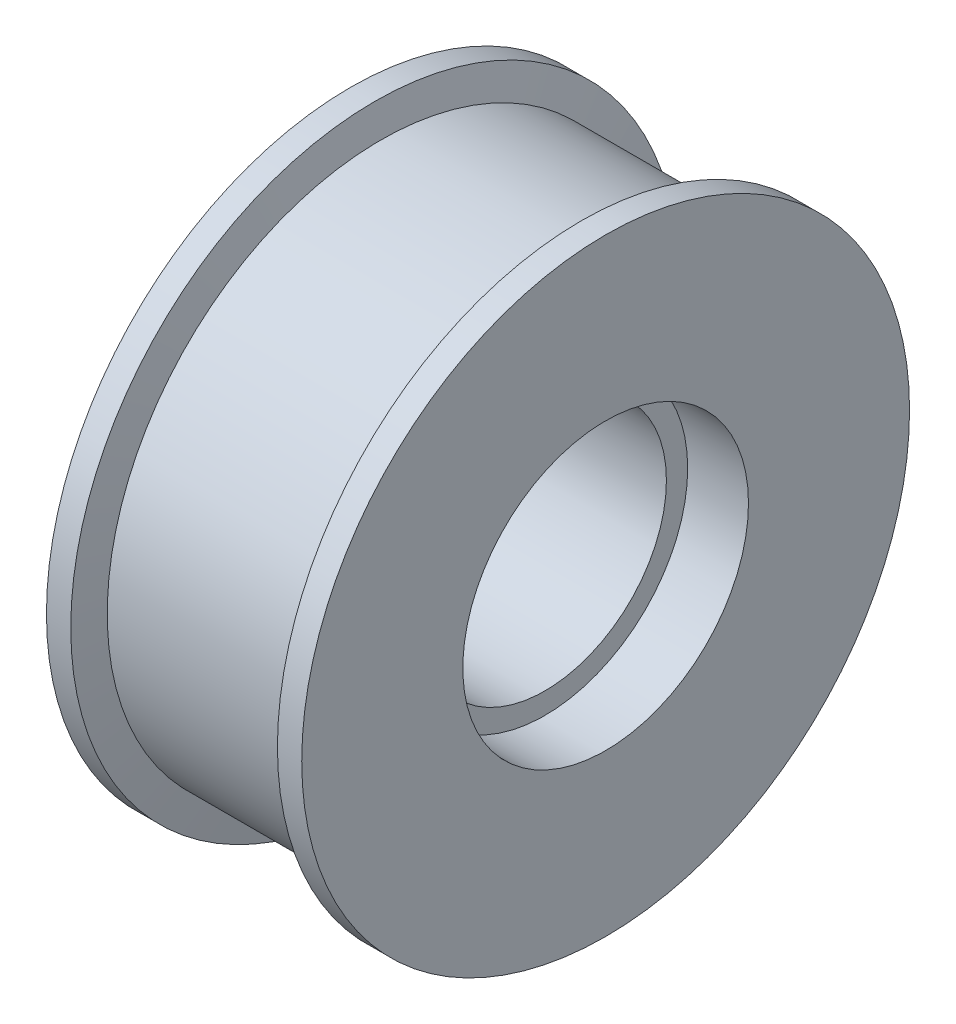
ISO-10303-21;
HEADER;
FILE_DESCRIPTION(('STEP AP214'),'2;1');
FILE_NAME('part.step','',(''),(''),'','','');
FILE_SCHEMA(('AUTOMOTIVE_DESIGN { 1 0 10303 214 1 1 1 1 }'));
ENDSEC;
DATA;
#1=APPLICATION_CONTEXT('core data for automotive mechanical design processes');
#2=APPLICATION_PROTOCOL_DEFINITION('international standard','automotive_design',2000,#1);
#3=PRODUCT_CONTEXT('',#1,'mechanical');
#4=PRODUCT('Part','Part','',(#3));
#5=PRODUCT_RELATED_PRODUCT_CATEGORY('part','',(#4));
#6=PRODUCT_DEFINITION_FORMATION('','',#4);
#7=PRODUCT_DEFINITION_CONTEXT('part definition',#1,'design');
#8=PRODUCT_DEFINITION('design','',#6,#7);
#9=PRODUCT_DEFINITION_SHAPE('','',#8);
#10=(LENGTH_UNIT() NAMED_UNIT(*) SI_UNIT(.MILLI.,.METRE.));
#11=(NAMED_UNIT(*) PLANE_ANGLE_UNIT() SI_UNIT($,.RADIAN.));
#12=(NAMED_UNIT(*) SI_UNIT($,.STERADIAN.) SOLID_ANGLE_UNIT());
#13=UNCERTAINTY_MEASURE_WITH_UNIT(LENGTH_MEASURE(1.E-05),#10,'distance_accuracy_value','');
#14=(GEOMETRIC_REPRESENTATION_CONTEXT(3) GLOBAL_UNCERTAINTY_ASSIGNED_CONTEXT((#13)) GLOBAL_UNIT_ASSIGNED_CONTEXT((#10,
#11,#12)) REPRESENTATION_CONTEXT('',''));
#15=CARTESIAN_POINT('',(0.,0.,0.));
#16=DIRECTION('',(0.,0.,1.));
#17=DIRECTION('',(1.,0.,0.));
#18=AXIS2_PLACEMENT_3D('',#15,#16,#17);
#19=CARTESIAN_POINT('',(43.903105843662,-758.58002712801,663.895907566101));
#20=DIRECTION('',(1.,0.,0.));
#21=DIRECTION('',(0.,0.,-1.));
#22=AXIS2_PLACEMENT_3D('',#19,#20,#21);
#23=CYLINDRICAL_SURFACE('',#22,23.5);
#24=CARTESIAN_POINT('',(22.8923695623669,-758.58002712801,663.895907566101));
#25=DIRECTION('',(1.,0.,0.));
#26=DIRECTION('',(0.,0.,-1.));
#27=AXIS2_PLACEMENT_3D('',#24,#25,#26);
#28=CIRCLE('',#27,23.5);
#29=CARTESIAN_POINT('',(22.8923695623669,-758.58002712801,640.395907566101));
#30=VERTEX_POINT('',#29);
#31=EDGE_CURVE('E70',#30,#30,#28,.T.);
#32=ORIENTED_EDGE('',*,*,#31,.F.);
#33=EDGE_LOOP('',(#32));
#34=FACE_BOUND('',#33,.T.);
#35=CARTESIAN_POINT('',(32.892369562367,-758.58002712801,663.895907566101));
#36=DIRECTION('',(1.,0.,0.));
#37=DIRECTION('',(0.,0.,-1.));
#38=AXIS2_PLACEMENT_3D('',#35,#36,#37);
#39=CIRCLE('',#38,23.5);
#40=CARTESIAN_POINT('',(32.892369562367,-758.58002712801,640.395907566101));
#41=VERTEX_POINT('',#40);
#42=EDGE_CURVE('E10',#41,#41,#39,.T.);
#43=ORIENTED_EDGE('',*,*,#42,.T.);
#44=EDGE_LOOP('',(#43));
#45=FACE_BOUND('',#44,.T.);
#46=ADVANCED_FACE('F30',(#34,#45),#23,.F.);
#47=CARTESIAN_POINT('',(32.892369562367,-774.762591535569,646.855525845165));
#48=DIRECTION('',(-1.,0.,0.));
#49=DIRECTION('',(0.,0.,1.));
#50=AXIS2_PLACEMENT_3D('',#47,#48,#49);
#51=PLANE('',#50);
#52=ORIENTED_EDGE('',*,*,#42,.F.);
#53=EDGE_LOOP('',(#52));
#54=FACE_BOUND('',#53,.T.);
#55=CARTESIAN_POINT('',(32.892369562367,-758.58002712801,663.895907566101));
#56=DIRECTION('',(1.,0.,0.));
#57=DIRECTION('',(0.,0.,-1.));
#58=AXIS2_PLACEMENT_3D('',#55,#56,#57);
#59=CIRCLE('',#58,50.);
#60=CARTESIAN_POINT('',(32.892369562367,-758.58002712801,613.895907566101));
#61=VERTEX_POINT('',#60);
#62=EDGE_CURVE('E36',#61,#61,#59,.T.);
#63=ORIENTED_EDGE('',*,*,#62,.T.);
#64=EDGE_LOOP('',(#63));
#65=FACE_BOUND('',#64,.T.);
#66=ADVANCED_FACE('F77',(#54,#65),#51,.F.);
#67=CARTESIAN_POINT('',(43.903105843662,-758.58002712801,663.895907566101));
#68=DIRECTION('',(1.,0.,0.));
#69=DIRECTION('',(0.,0.,-1.));
#70=AXIS2_PLACEMENT_3D('',#67,#68,#69);
#71=CYLINDRICAL_SURFACE('',#70,50.);
#72=ORIENTED_EDGE('',*,*,#62,.F.);
#73=EDGE_LOOP('',(#72));
#74=FACE_BOUND('',#73,.T.);
#75=CARTESIAN_POINT('',(28.8923695623669,-758.58002712801,663.895907566101));
#76=DIRECTION('',(1.,0.,0.));
#77=DIRECTION('',(0.,0.,-1.));
#78=AXIS2_PLACEMENT_3D('',#75,#76,#77);
#79=CIRCLE('',#78,50.);
#80=CARTESIAN_POINT('',(28.8923695623669,-758.58002712801,613.895907566101));
#81=VERTEX_POINT('',#80);
#82=EDGE_CURVE('E40',#81,#81,#79,.T.);
#83=ORIENTED_EDGE('',*,*,#82,.T.);
#84=EDGE_LOOP('',(#83));
#85=FACE_BOUND('',#84,.T.);
#86=ADVANCED_FACE('F81',(#74,#85),#71,.T.);
#87=CARTESIAN_POINT('',(27.8923695623669,-758.58002712801,663.895907566101));
#88=DIRECTION('',(1.,0.,0.));
#89=DIRECTION('',(0.,0.,-1.));
#90=AXIS2_PLACEMENT_3D('',#87,#88,#89);
#91=CONICAL_SURFACE('',#90,45.,1.37340076694502);
#92=ORIENTED_EDGE('',*,*,#82,.F.);
#93=EDGE_LOOP('',(#92));
#94=FACE_BOUND('',#93,.T.);
#95=CARTESIAN_POINT('',(27.8923695623669,-758.58002712801,663.895907566101));
#96=DIRECTION('',(1.,0.,0.));
#97=DIRECTION('',(0.,0.,-1.));
#98=AXIS2_PLACEMENT_3D('',#95,#96,#97);
#99=CIRCLE('',#98,45.);
#100=CARTESIAN_POINT('',(27.8923695623669,-758.58002712801,618.895907566101));
#101=VERTEX_POINT('',#100);
#102=EDGE_CURVE('E44',#101,#101,#99,.T.);
#103=ORIENTED_EDGE('',*,*,#102,.T.);
#104=EDGE_LOOP('',(#103));
#105=FACE_BOUND('',#104,.T.);
#106=ADVANCED_FACE('F86',(#94,#105),#91,.T.);
#107=CARTESIAN_POINT('',(43.903105843662,-758.58002712801,663.895907566101));
#108=DIRECTION('',(1.,0.,0.));
#109=DIRECTION('',(0.,0.,-1.));
#110=AXIS2_PLACEMENT_3D('',#107,#108,#109);
#111=CYLINDRICAL_SURFACE('',#110,45.);
#112=ORIENTED_EDGE('',*,*,#102,.F.);
#113=EDGE_LOOP('',(#112));
#114=FACE_BOUND('',#113,.T.);
#115=CARTESIAN_POINT('',(-4.10763043763306,-758.58002712801,663.895907566101));
#116=DIRECTION('',(1.,0.,0.));
#117=DIRECTION('',(0.,0.,-1.));
#118=AXIS2_PLACEMENT_3D('',#115,#116,#117);
#119=CIRCLE('',#118,45.);
#120=CARTESIAN_POINT('',(-4.10763043763306,-758.58002712801,618.895907566101));
#121=VERTEX_POINT('',#120);
#122=EDGE_CURVE('E49',#121,#121,#119,.T.);
#123=ORIENTED_EDGE('',*,*,#122,.T.);
#124=EDGE_LOOP('',(#123));
#125=FACE_BOUND('',#124,.T.);
#126=ADVANCED_FACE('F92',(#114,#125),#111,.T.);
#127=CARTESIAN_POINT('',(-5.10763043763305,-758.58002712801,663.895907566101));
#128=DIRECTION('',(-1.,0.,0.));
#129=DIRECTION('',(0.,0.,1.));
#130=AXIS2_PLACEMENT_3D('',#127,#128,#129);
#131=CONICAL_SURFACE('',#130,50.,1.37340076694502);
#132=ORIENTED_EDGE('',*,*,#122,.F.);
#133=EDGE_LOOP('',(#132));
#134=FACE_BOUND('',#133,.T.);
#135=CARTESIAN_POINT('',(-5.10763043763305,-758.58002712801,663.895907566101));
#136=DIRECTION('',(1.,0.,0.));
#137=DIRECTION('',(0.,0.,-1.));
#138=AXIS2_PLACEMENT_3D('',#135,#136,#137);
#139=CIRCLE('',#138,50.);
#140=CARTESIAN_POINT('',(-5.10763043763305,-758.58002712801,613.895907566101));
#141=VERTEX_POINT('',#140);
#142=EDGE_CURVE('E52',#141,#141,#139,.T.);
#143=ORIENTED_EDGE('',*,*,#142,.T.);
#144=EDGE_LOOP('',(#143));
#145=FACE_BOUND('',#144,.T.);
#146=ADVANCED_FACE('F96',(#134,#145),#131,.T.);
#147=CARTESIAN_POINT('',(43.903105843662,-758.58002712801,663.895907566101));
#148=DIRECTION('',(1.,0.,0.));
#149=DIRECTION('',(0.,0.,-1.));
#150=AXIS2_PLACEMENT_3D('',#147,#148,#149);
#151=CYLINDRICAL_SURFACE('',#150,50.);
#152=ORIENTED_EDGE('',*,*,#142,.F.);
#153=EDGE_LOOP('',(#152));
#154=FACE_BOUND('',#153,.T.);
#155=CARTESIAN_POINT('',(-9.10763043763305,-758.58002712801,663.895907566101));
#156=DIRECTION('',(1.,0.,0.));
#157=DIRECTION('',(0.,0.,-1.));
#158=AXIS2_PLACEMENT_3D('',#155,#156,#157);
#159=CIRCLE('',#158,50.);
#160=CARTESIAN_POINT('',(-9.10763043763305,-758.58002712801,613.895907566101));
#161=VERTEX_POINT('',#160);
#162=EDGE_CURVE('E55',#161,#161,#159,.T.);
#163=ORIENTED_EDGE('',*,*,#162,.T.);
#164=EDGE_LOOP('',(#163));
#165=FACE_BOUND('',#164,.T.);
#166=ADVANCED_FACE('F100',(#154,#165),#151,.T.);
#167=CARTESIAN_POINT('',(-9.10763043763306,-793.011015229199,627.639776244961));
#168=DIRECTION('',(1.,0.,0.));
#169=DIRECTION('',(0.,0.,-1.));
#170=AXIS2_PLACEMENT_3D('',#167,#168,#169);
#171=PLANE('',#170);
#172=ORIENTED_EDGE('',*,*,#162,.F.);
#173=EDGE_LOOP('',(#172));
#174=FACE_BOUND('',#173,.T.);
#175=CARTESIAN_POINT('',(-9.10763043763306,-758.58002712801,663.895907566101));
#176=DIRECTION('',(1.,0.,0.));
#177=DIRECTION('',(0.,0.,-1.));
#178=AXIS2_PLACEMENT_3D('',#175,#176,#177);
#179=CIRCLE('',#178,23.5);
#180=CARTESIAN_POINT('',(-9.10763043763306,-758.58002712801,640.395907566101));
#181=VERTEX_POINT('',#180);
#182=EDGE_CURVE('E58',#181,#181,#179,.T.);
#183=ORIENTED_EDGE('',*,*,#182,.T.);
#184=EDGE_LOOP('',(#183));
#185=FACE_BOUND('',#184,.T.);
#186=ADVANCED_FACE('F104',(#174,#185),#171,.F.);
#187=CARTESIAN_POINT('',(43.903105843662,-758.58002712801,663.895907566101));
#188=DIRECTION('',(1.,0.,0.));
#189=DIRECTION('',(0.,0.,-1.));
#190=AXIS2_PLACEMENT_3D('',#187,#188,#189);
#191=CYLINDRICAL_SURFACE('',#190,23.5);
#192=ORIENTED_EDGE('',*,*,#182,.F.);
#193=EDGE_LOOP('',(#192));
#194=FACE_BOUND('',#193,.T.);
#195=CARTESIAN_POINT('',(0.892369562366942,-758.58002712801,663.895907566101));
#196=DIRECTION('',(1.,0.,0.));
#197=DIRECTION('',(0.,0.,-1.));
#198=AXIS2_PLACEMENT_3D('',#195,#196,#197);
#199=CIRCLE('',#198,23.5);
#200=CARTESIAN_POINT('',(0.892369562366942,-758.58002712801,640.395907566101));
#201=VERTEX_POINT('',#200);
#202=EDGE_CURVE('E61',#201,#201,#199,.T.);
#203=ORIENTED_EDGE('',*,*,#202,.T.);
#204=EDGE_LOOP('',(#203));
#205=FACE_BOUND('',#204,.T.);
#206=ADVANCED_FACE('F108',(#194,#205),#191,.F.);
#207=CARTESIAN_POINT('',(0.892369562366941,-772.352422368486,649.393455037645));
#208=DIRECTION('',(1.,0.,0.));
#209=DIRECTION('',(0.,0.,-1.));
#210=AXIS2_PLACEMENT_3D('',#207,#208,#209);
#211=PLANE('',#210);
#212=ORIENTED_EDGE('',*,*,#202,.F.);
#213=EDGE_LOOP('',(#212));
#214=FACE_BOUND('',#213,.T.);
#215=CARTESIAN_POINT('',(0.892369562366942,-758.58002712801,663.895907566101));
#216=DIRECTION('',(1.,0.,0.));
#217=DIRECTION('',(0.,0.,-1.));
#218=AXIS2_PLACEMENT_3D('',#215,#216,#217);
#219=CIRCLE('',#218,20.);
#220=CARTESIAN_POINT('',(0.892369562366942,-758.58002712801,643.895907566101));
#221=VERTEX_POINT('',#220);
#222=EDGE_CURVE('E64',#221,#221,#219,.T.);
#223=ORIENTED_EDGE('',*,*,#222,.T.);
#224=EDGE_LOOP('',(#223));
#225=FACE_BOUND('',#224,.T.);
#226=ADVANCED_FACE('F112',(#214,#225),#211,.F.);
#227=CARTESIAN_POINT('',(43.903105843662,-758.58002712801,663.895907566101));
#228=DIRECTION('',(1.,0.,0.));
#229=DIRECTION('',(0.,0.,-1.));
#230=AXIS2_PLACEMENT_3D('',#227,#228,#229);
#231=CYLINDRICAL_SURFACE('',#230,20.);
#232=ORIENTED_EDGE('',*,*,#222,.F.);
#233=EDGE_LOOP('',(#232));
#234=FACE_BOUND('',#233,.T.);
#235=CARTESIAN_POINT('',(22.8923695623669,-758.58002712801,663.895907566101));
#236=DIRECTION('',(1.,0.,0.));
#237=DIRECTION('',(0.,0.,-1.));
#238=AXIS2_PLACEMENT_3D('',#235,#236,#237);
#239=CIRCLE('',#238,20.);
#240=CARTESIAN_POINT('',(22.8923695623669,-758.58002712801,643.895907566101));
#241=VERTEX_POINT('',#240);
#242=EDGE_CURVE('E67',#241,#241,#239,.T.);
#243=ORIENTED_EDGE('',*,*,#242,.T.);
#244=EDGE_LOOP('',(#243));
#245=FACE_BOUND('',#244,.T.);
#246=ADVANCED_FACE('F116',(#234,#245),#231,.F.);
#247=CARTESIAN_POINT('',(22.8923695623669,-774.762591535569,646.855525845165));
#248=DIRECTION('',(-1.,0.,0.));
#249=DIRECTION('',(0.,0.,1.));
#250=AXIS2_PLACEMENT_3D('',#247,#248,#249);
#251=PLANE('',#250);
#252=ORIENTED_EDGE('',*,*,#242,.F.);
#253=EDGE_LOOP('',(#252));
#254=FACE_BOUND('',#253,.T.);
#255=ORIENTED_EDGE('',*,*,#31,.T.);
#256=EDGE_LOOP('',(#255));
#257=FACE_BOUND('',#256,.T.);
#258=ADVANCED_FACE('F74',(#254,#257),#251,.F.);
#259=CLOSED_SHELL('',(#46,#66,#86,#106,#126,#146,#166,#186,#206,#226,#246,#258));
#260=MANIFOLD_SOLID_BREP('B2',#259);
#261=ADVANCED_BREP_SHAPE_REPRESENTATION('',(#18,#260),#14);
#262=SHAPE_DEFINITION_REPRESENTATION(#9,#261);
ENDSEC;
END-ISO-10303-21;
